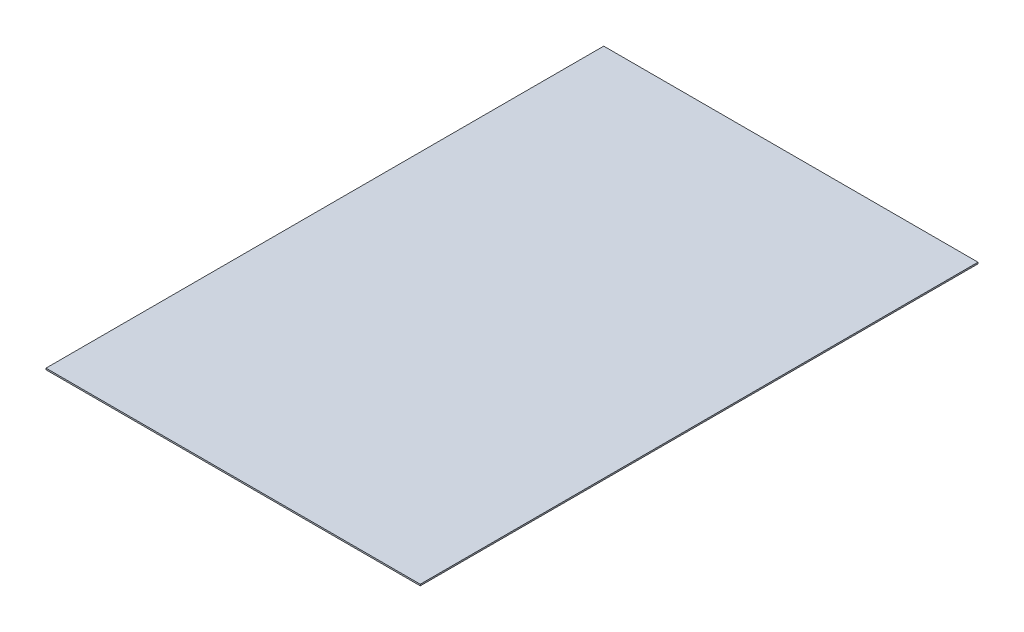
ISO-10303-21;
HEADER;
FILE_DESCRIPTION(('STEP AP214'),'2;1');
FILE_NAME('part.step','',(''),(''),'','','');
FILE_SCHEMA(('AUTOMOTIVE_DESIGN { 1 0 10303 214 1 1 1 1 }'));
ENDSEC;
DATA;
#1=APPLICATION_CONTEXT('core data for automotive mechanical design processes');
#2=APPLICATION_PROTOCOL_DEFINITION('international standard','automotive_design',2000,#1);
#3=PRODUCT_CONTEXT('',#1,'mechanical');
#4=PRODUCT('Part','Part','',(#3));
#5=PRODUCT_RELATED_PRODUCT_CATEGORY('part','',(#4));
#6=PRODUCT_DEFINITION_FORMATION('','',#4);
#7=PRODUCT_DEFINITION_CONTEXT('part definition',#1,'design');
#8=PRODUCT_DEFINITION('design','',#6,#7);
#9=PRODUCT_DEFINITION_SHAPE('','',#8);
#10=(LENGTH_UNIT() NAMED_UNIT(*) SI_UNIT(.MILLI.,.METRE.));
#11=(NAMED_UNIT(*) PLANE_ANGLE_UNIT() SI_UNIT($,.RADIAN.));
#12=(NAMED_UNIT(*) SI_UNIT($,.STERADIAN.) SOLID_ANGLE_UNIT());
#13=UNCERTAINTY_MEASURE_WITH_UNIT(LENGTH_MEASURE(1.E-05),#10,'distance_accuracy_value','');
#14=(GEOMETRIC_REPRESENTATION_CONTEXT(3) GLOBAL_UNCERTAINTY_ASSIGNED_CONTEXT((#13)) GLOBAL_UNIT_ASSIGNED_CONTEXT((#10,
#11,#12)) REPRESENTATION_CONTEXT('',''));
#15=CARTESIAN_POINT('',(0.,0.,0.));
#16=DIRECTION('',(0.,0.,1.));
#17=DIRECTION('',(1.,0.,0.));
#18=AXIS2_PLACEMENT_3D('',#15,#16,#17);
#19=CARTESIAN_POINT('',(-255.,2.,380.));
#20=DIRECTION('',(1.,0.,0.));
#21=DIRECTION('',(0.,0.,-1.));
#22=AXIS2_PLACEMENT_3D('',#19,#20,#21);
#23=PLANE('',#22);
#24=DIRECTION('',(0.,0.,1.));
#25=VECTOR('',#24,1.);
#26=CARTESIAN_POINT('',(-255.,0.,380.));
#27=LINE('',#26,#25);
#28=CARTESIAN_POINT('',(-255.,0.,-380.));
#29=VERTEX_POINT('',#28);
#30=CARTESIAN_POINT('',(-255.,0.,380.));
#31=VERTEX_POINT('',#30);
#32=EDGE_CURVE('E99',#29,#31,#27,.T.);
#33=ORIENTED_EDGE('',*,*,#32,.T.);
#34=DIRECTION('',(0.,-1.,0.));
#35=VECTOR('',#34,1.);
#36=CARTESIAN_POINT('',(-255.,2.,380.));
#37=LINE('',#36,#35);
#38=CARTESIAN_POINT('',(-255.,2.,380.));
#39=VERTEX_POINT('',#38);
#40=EDGE_CURVE('E11',#39,#31,#37,.T.);
#41=ORIENTED_EDGE('',*,*,#40,.F.);
#42=DIRECTION('',(0.,0.,1.));
#43=VECTOR('',#42,1.);
#44=CARTESIAN_POINT('',(-255.,2.,380.));
#45=LINE('',#44,#43);
#46=CARTESIAN_POINT('',(-255.,2.,-380.));
#47=VERTEX_POINT('',#46);
#48=EDGE_CURVE('E87',#47,#39,#45,.T.);
#49=ORIENTED_EDGE('',*,*,#48,.F.);
#50=DIRECTION('',(0.,-1.,0.));
#51=VECTOR('',#50,1.);
#52=CARTESIAN_POINT('',(-255.,2.,-380.));
#53=LINE('',#52,#51);
#54=EDGE_CURVE('E95',#47,#29,#53,.T.);
#55=ORIENTED_EDGE('',*,*,#54,.T.);
#56=EDGE_LOOP('',(#33,#41,#49,#55));
#57=FACE_BOUND('',#56,.T.);
#58=ADVANCED_FACE('F36',(#57),#23,.F.);
#59=CARTESIAN_POINT('',(255.,2.,380.));
#60=DIRECTION('',(0.,0.,-1.));
#61=DIRECTION('',(-1.,0.,0.));
#62=AXIS2_PLACEMENT_3D('',#59,#60,#61);
#63=PLANE('',#62);
#64=DIRECTION('',(1.,0.,0.));
#65=VECTOR('',#64,1.);
#66=CARTESIAN_POINT('',(255.,0.,380.));
#67=LINE('',#66,#65);
#68=CARTESIAN_POINT('',(255.,0.,380.));
#69=VERTEX_POINT('',#68);
#70=EDGE_CURVE('E91',#31,#69,#67,.T.);
#71=ORIENTED_EDGE('',*,*,#70,.T.);
#72=DIRECTION('',(0.,-1.,0.));
#73=VECTOR('',#72,1.);
#74=CARTESIAN_POINT('',(255.,2.,380.));
#75=LINE('',#74,#73);
#76=CARTESIAN_POINT('',(255.,2.,380.));
#77=VERTEX_POINT('',#76);
#78=EDGE_CURVE('E44',#77,#69,#75,.T.);
#79=ORIENTED_EDGE('',*,*,#78,.F.);
#80=DIRECTION('',(1.,0.,0.));
#81=VECTOR('',#80,1.);
#82=CARTESIAN_POINT('',(255.,2.,380.));
#83=LINE('',#82,#81);
#84=EDGE_CURVE('E82',#39,#77,#83,.T.);
#85=ORIENTED_EDGE('',*,*,#84,.F.);
#86=ORIENTED_EDGE('',*,*,#40,.T.);
#87=EDGE_LOOP('',(#71,#79,#85,#86));
#88=FACE_BOUND('',#87,.T.);
#89=ADVANCED_FACE('F90',(#88),#63,.F.);
#90=CARTESIAN_POINT('',(255.,2.,380.));
#91=DIRECTION('',(-1.,0.,0.));
#92=DIRECTION('',(0.,0.,1.));
#93=AXIS2_PLACEMENT_3D('',#90,#91,#92);
#94=PLANE('',#93);
#95=DIRECTION('',(0.,0.,-1.));
#96=VECTOR('',#95,1.);
#97=CARTESIAN_POINT('',(255.,0.,380.));
#98=LINE('',#97,#96);
#99=CARTESIAN_POINT('',(255.,0.,-380.));
#100=VERTEX_POINT('',#99);
#101=EDGE_CURVE('E69',#69,#100,#98,.T.);
#102=ORIENTED_EDGE('',*,*,#101,.T.);
#103=DIRECTION('',(0.,-1.,0.));
#104=VECTOR('',#103,1.);
#105=CARTESIAN_POINT('',(255.,2.,-380.));
#106=LINE('',#105,#104);
#107=CARTESIAN_POINT('',(255.,2.,-380.));
#108=VERTEX_POINT('',#107);
#109=EDGE_CURVE('E92',#108,#100,#106,.T.);
#110=ORIENTED_EDGE('',*,*,#109,.F.);
#111=DIRECTION('',(0.,0.,-1.));
#112=VECTOR('',#111,1.);
#113=CARTESIAN_POINT('',(255.,2.,380.));
#114=LINE('',#113,#112);
#115=EDGE_CURVE('E85',#77,#108,#114,.T.);
#116=ORIENTED_EDGE('',*,*,#115,.F.);
#117=ORIENTED_EDGE('',*,*,#78,.T.);
#118=EDGE_LOOP('',(#102,#110,#116,#117));
#119=FACE_BOUND('',#118,.T.);
#120=ADVANCED_FACE('F93',(#119),#94,.F.);
#121=CARTESIAN_POINT('',(255.,2.,-380.));
#122=DIRECTION('',(0.,0.,1.));
#123=DIRECTION('',(1.,0.,0.));
#124=AXIS2_PLACEMENT_3D('',#121,#122,#123);
#125=PLANE('',#124);
#126=DIRECTION('',(-1.,0.,0.));
#127=VECTOR('',#126,1.);
#128=CARTESIAN_POINT('',(255.,0.,-380.));
#129=LINE('',#128,#127);
#130=EDGE_CURVE('E75',#100,#29,#129,.T.);
#131=ORIENTED_EDGE('',*,*,#130,.T.);
#132=ORIENTED_EDGE('',*,*,#54,.F.);
#133=DIRECTION('',(-1.,0.,0.));
#134=VECTOR('',#133,1.);
#135=CARTESIAN_POINT('',(255.,2.,-380.));
#136=LINE('',#135,#134);
#137=EDGE_CURVE('E52',#108,#47,#136,.T.);
#138=ORIENTED_EDGE('',*,*,#137,.F.);
#139=ORIENTED_EDGE('',*,*,#109,.T.);
#140=EDGE_LOOP('',(#131,#132,#138,#139));
#141=FACE_BOUND('',#140,.T.);
#142=ADVANCED_FACE('F106',(#141),#125,.F.);
#143=CARTESIAN_POINT('',(0.,2.,0.));
#144=DIRECTION('',(0.,1.,0.));
#145=DIRECTION('',(0.,0.,1.));
#146=AXIS2_PLACEMENT_3D('',#143,#144,#145);
#147=PLANE('',#146);
#148=ORIENTED_EDGE('',*,*,#48,.T.);
#149=ORIENTED_EDGE('',*,*,#84,.T.);
#150=ORIENTED_EDGE('',*,*,#115,.T.);
#151=ORIENTED_EDGE('',*,*,#137,.T.);
#152=EDGE_LOOP('',(#148,#149,#150,#151));
#153=FACE_BOUND('',#152,.T.);
#154=ADVANCED_FACE('F83',(#153),#147,.T.);
#155=CARTESIAN_POINT('',(0.,0.,0.));
#156=DIRECTION('',(0.,1.,0.));
#157=DIRECTION('',(0.,0.,1.));
#158=AXIS2_PLACEMENT_3D('',#155,#156,#157);
#159=PLANE('',#158);
#160=ORIENTED_EDGE('',*,*,#32,.F.);
#161=ORIENTED_EDGE('',*,*,#130,.F.);
#162=ORIENTED_EDGE('',*,*,#101,.F.);
#163=ORIENTED_EDGE('',*,*,#70,.F.);
#164=EDGE_LOOP('',(#160,#161,#162,#163));
#165=FACE_BOUND('',#164,.T.);
#166=ADVANCED_FACE('F109',(#165),#159,.F.);
#167=CLOSED_SHELL('',(#58,#89,#120,#142,#154,#166));
#168=MANIFOLD_SOLID_BREP('B2',#167);
#169=ADVANCED_BREP_SHAPE_REPRESENTATION('',(#18,#168),#14);
#170=SHAPE_DEFINITION_REPRESENTATION(#9,#169);
ENDSEC;
END-ISO-10303-21;
